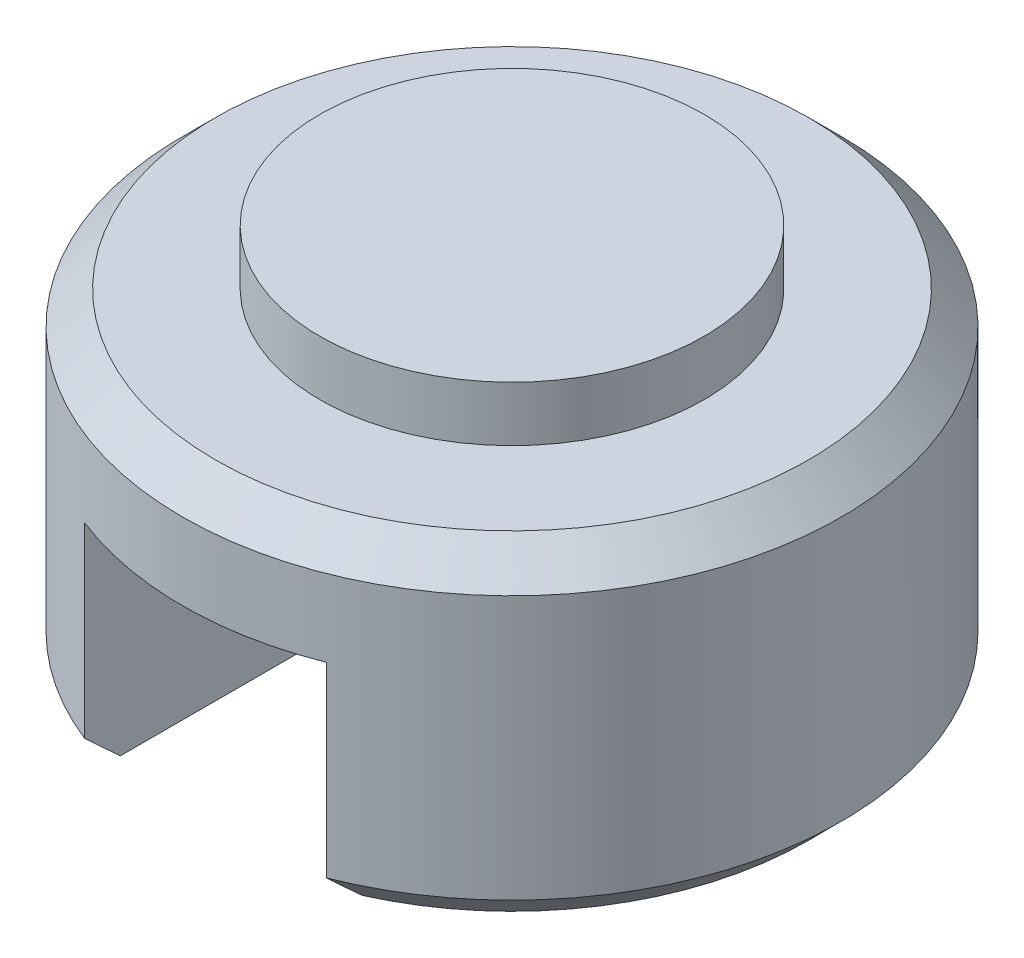
ISO-10303-21;
HEADER;
FILE_DESCRIPTION(('STEP AP214'),'2;1');
FILE_NAME('part.step','',(''),(''),'','','');
FILE_SCHEMA(('AUTOMOTIVE_DESIGN { 1 0 10303 214 1 1 1 1 }'));
ENDSEC;
DATA;
#1=APPLICATION_CONTEXT('core data for automotive mechanical design processes');
#2=APPLICATION_PROTOCOL_DEFINITION('international standard','automotive_design',2000,#1);
#3=PRODUCT_CONTEXT('',#1,'mechanical');
#4=PRODUCT('Part','Part','',(#3));
#5=PRODUCT_RELATED_PRODUCT_CATEGORY('part','',(#4));
#6=PRODUCT_DEFINITION_FORMATION('','',#4);
#7=PRODUCT_DEFINITION_CONTEXT('part definition',#1,'design');
#8=PRODUCT_DEFINITION('design','',#6,#7);
#9=PRODUCT_DEFINITION_SHAPE('','',#8);
#10=(LENGTH_UNIT() NAMED_UNIT(*) SI_UNIT(.MILLI.,.METRE.));
#11=(NAMED_UNIT(*) PLANE_ANGLE_UNIT() SI_UNIT($,.RADIAN.));
#12=(NAMED_UNIT(*) SI_UNIT($,.STERADIAN.) SOLID_ANGLE_UNIT());
#13=UNCERTAINTY_MEASURE_WITH_UNIT(LENGTH_MEASURE(1.E-05),#10,'distance_accuracy_value','');
#14=(GEOMETRIC_REPRESENTATION_CONTEXT(3) GLOBAL_UNCERTAINTY_ASSIGNED_CONTEXT((#13)) GLOBAL_UNIT_ASSIGNED_CONTEXT((#10,
#11,#12)) REPRESENTATION_CONTEXT('',''));
#15=CARTESIAN_POINT('',(0.,0.,0.));
#16=DIRECTION('',(0.,0.,1.));
#17=DIRECTION('',(1.,0.,0.));
#18=AXIS2_PLACEMENT_3D('',#15,#16,#17);
#19=CARTESIAN_POINT('',(-1.4986,-1.7272,-2.413));
#20=DIRECTION('',(0.,1.,0.));
#21=DIRECTION('',(0.,0.,1.));
#22=AXIS2_PLACEMENT_3D('',#19,#20,#21);
#23=PLANE('',#22);
#24=CARTESIAN_POINT('',(-1.4986,-1.7272,-2.413));
#25=DIRECTION('',(0.,-1.,0.));
#26=DIRECTION('',(0.,0.,-1.));
#27=AXIS2_PLACEMENT_3D('',#24,#25,#26);
#28=CIRCLE('',#27,0.762);
#29=CARTESIAN_POINT('',(-1.778,-1.7272,-1.70407148456274));
#30=VERTEX_POINT('',#29);
#31=CARTESIAN_POINT('',(-1.2192,-1.7272,-1.70407148456287));
#32=VERTEX_POINT('',#31);
#33=EDGE_CURVE('E19',#30,#32,#28,.F.);
#34=ORIENTED_EDGE('',*,*,#33,.F.);
#35=DIRECTION('',(0.,0.,-1.));
#36=VECTOR('',#35,1.);
#37=CARTESIAN_POINT('',(-1.778,-1.7272,-2.41299985997082));
#38=LINE('',#37,#36);
#39=CARTESIAN_POINT('',(-1.778,-1.7272,-3.12192851543713));
#40=VERTEX_POINT('',#39);
#41=EDGE_CURVE('E67',#40,#30,#38,.F.);
#42=ORIENTED_EDGE('',*,*,#41,.F.);
#43=CARTESIAN_POINT('',(-1.4986,-1.7272,-2.413));
#44=DIRECTION('',(0.,-1.,0.));
#45=DIRECTION('',(0.,0.,-1.));
#46=AXIS2_PLACEMENT_3D('',#43,#44,#45);
#47=CIRCLE('',#46,0.762);
#48=CARTESIAN_POINT('',(-1.2192,-1.7272,-3.12192851543713));
#49=VERTEX_POINT('',#48);
#50=EDGE_CURVE('E74',#49,#40,#47,.F.);
#51=ORIENTED_EDGE('',*,*,#50,.F.);
#52=DIRECTION('',(0.,0.,-1.));
#53=VECTOR('',#52,1.);
#54=CARTESIAN_POINT('',(-1.2192,-1.7272,-2.41300013996594));
#55=LINE('',#54,#53);
#56=EDGE_CURVE('E70',#49,#32,#55,.F.);
#57=ORIENTED_EDGE('',*,*,#56,.T.);
#58=EDGE_LOOP('',(#34,#42,#51,#57));
#59=FACE_BOUND('',#58,.T.);
#60=ADVANCED_FACE('F16',(#59),#23,.F.);
#61=CARTESIAN_POINT('',(-1.4986,-1.3462,-2.41299995087691));
#62=DIRECTION('',(0.,1.,0.));
#63=DIRECTION('',(0.,0.,1.));
#64=AXIS2_PLACEMENT_3D('',#61,#62,#63);
#65=PLANE('',#64);
#66=CARTESIAN_POINT('',(-1.4986,-1.3462,-2.413));
#67=DIRECTION('',(0.,-1.,0.));
#68=DIRECTION('',(0.,0.,-1.));
#69=AXIS2_PLACEMENT_3D('',#66,#67,#68);
#70=CIRCLE('',#69,0.4445);
#71=CARTESIAN_POINT('',(-1.4986,-1.3462,-2.8575));
#72=VERTEX_POINT('',#71);
#73=EDGE_CURVE('E104',#72,#72,#70,.T.);
#74=ORIENTED_EDGE('',*,*,#73,.F.);
#75=EDGE_LOOP('',(#74));
#76=FACE_BOUND('',#75,.T.);
#77=ADVANCED_FACE('F154',(#76),#65,.T.);
#78=CARTESIAN_POINT('',(-1.778,-1.98120064167842,-2.41299985997082));
#79=DIRECTION('',(1.,0.,0.));
#80=DIRECTION('',(0.,0.,-1.));
#81=AXIS2_PLACEMENT_3D('',#78,#79,#80);
#82=PLANE('',#81);
#83=CARTESIAN_POINT('',(-1.77799998033145,-2.23520005533869,-3.0393043804287));
#84=CARTESIAN_POINT('',(-1.77799999016572,-2.2225635165552,-3.05313361230183));
#85=CARTESIAN_POINT('',(-1.77799999672191,-2.20989524076586,-3.06693357474173));
#86=CARTESIAN_POINT('',(-1.77800000327809,-2.18449522228523,-3.09447495304592));
#87=CARTESIAN_POINT('',(-1.77800000327809,-2.17176347962948,-3.10821636894298));
#88=CARTESIAN_POINT('',(-1.778,-2.15900000000342,-3.12192851543958));
#89=B_SPLINE_CURVE_WITH_KNOTS('',3,(#83,#84,#85,#86,#87,#88),.UNSPECIFIED.,.F.,.F.,(4,2,4),(0.,
0.0561989107844174,0.112397790107552),.UNSPECIFIED.);
#90=CARTESIAN_POINT('',(-1.778,-2.2352000283648,-3.03930443164851));
#91=VERTEX_POINT('',#90);
#92=CARTESIAN_POINT('',(-1.778,-2.15900000000288,-3.12192851543713));
#93=VERTEX_POINT('',#92);
#94=EDGE_CURVE('E142',#91,#93,#89,.T.);
#95=ORIENTED_EDGE('',*,*,#94,.T.);
#96=DIRECTION('',(0.,1.,0.));
#97=VECTOR('',#96,1.);
#98=CARTESIAN_POINT('',(-1.778,-1.98120064167842,-3.12192851543706));
#99=LINE('',#98,#97);
#100=EDGE_CURVE('E88',#93,#40,#99,.T.);
#101=ORIENTED_EDGE('',*,*,#100,.T.);
#102=ORIENTED_EDGE('',*,*,#41,.T.);
#103=DIRECTION('',(0.,1.,0.));
#104=VECTOR('',#103,1.);
#105=CARTESIAN_POINT('',(-1.778,-1.98120064167842,-1.70407148456269));
#106=LINE('',#105,#104);
#107=CARTESIAN_POINT('',(-1.778,-2.1590000534657,-1.70407154202793));
#108=VERTEX_POINT('',#107);
#109=EDGE_CURVE('E77',#30,#108,#106,.F.);
#110=ORIENTED_EDGE('',*,*,#109,.T.);
#111=CARTESIAN_POINT('',(-1.77800003719789,-2.15900012781875,-1.70407158006058));
#112=CARTESIAN_POINT('',(-1.77800001859895,-2.17176356577931,-1.71778370663565));
#113=CARTESIAN_POINT('',(-1.77800000619965,-2.1844952721957,-1.73152509759957));
#114=CARTESIAN_POINT('',(-1.77799999380035,-2.2098952290555,-1.75906641602039));
#115=CARTESIAN_POINT('',(-1.77799999380035,-2.22256347946336,-1.77286634351006));
#116=CARTESIAN_POINT('',(-1.778,-2.2351999982915,-1.78669553542139));
#117=B_SPLINE_CURVE_WITH_KNOTS('',3,(#111,#112,#113,#114,#115,#116),.UNSPECIFIED.,.F.,.F.,(4,2,
4),(0.,0.0561987505650383,0.112397532616329),.UNSPECIFIED.);
#118=CARTESIAN_POINT('',(-1.778,-2.23519999444256,-1.78669553120682));
#119=VERTEX_POINT('',#118);
#120=EDGE_CURVE('E83',#108,#119,#117,.T.);
#121=ORIENTED_EDGE('',*,*,#120,.T.);
#122=DIRECTION('',(0.,0.,1.));
#123=VECTOR('',#122,1.);
#124=CARTESIAN_POINT('',(-1.778,-2.2352,-2.41300000000025));
#125=LINE('',#124,#123);
#126=EDGE_CURVE('E107',#119,#91,#125,.F.);
#127=ORIENTED_EDGE('',*,*,#126,.T.);
#128=EDGE_LOOP('',(#95,#101,#102,#110,#121,#127));
#129=FACE_BOUND('',#128,.T.);
#130=ADVANCED_FACE('F87',(#129),#82,.T.);
#131=CARTESIAN_POINT('',(-1.2192,-1.98120064175691,-2.41300013996594));
#132=DIRECTION('',(1.,0.,0.));
#133=DIRECTION('',(0.,0.,-1.));
#134=AXIS2_PLACEMENT_3D('',#131,#132,#133);
#135=PLANE('',#134);
#136=DIRECTION('',(0.,0.,1.));
#137=VECTOR('',#136,1.);
#138=CARTESIAN_POINT('',(-1.2192,-2.2352,-2.41300000000025));
#139=LINE('',#138,#137);
#140=CARTESIAN_POINT('',(-1.2192,-2.23519997174926,-3.03930449364222));
#141=VERTEX_POINT('',#140);
#142=CARTESIAN_POINT('',(-1.2192,-2.23520000568704,-1.78669554351947));
#143=VERTEX_POINT('',#142);
#144=EDGE_CURVE('E103',#141,#143,#139,.T.);
#145=ORIENTED_EDGE('',*,*,#144,.T.);
#146=CARTESIAN_POINT('',(-1.2192,-2.15900000003543,-1.70407148453373));
#147=CARTESIAN_POINT('',(-1.2192,-2.17176347021186,-1.71778362447395));
#148=CARTESIAN_POINT('',(-1.2192,-2.18449520525468,-1.73152503212855));
#149=CARTESIAN_POINT('',(-1.2192,-2.20989521217468,-1.75906639056673));
#150=CARTESIAN_POINT('',(-1.2192,-2.22256348401636,-1.77286634138306));
#151=CARTESIAN_POINT('',(-1.2192,-2.23520002068896,-1.78669555994649));
#152=B_SPLINE_CURVE_WITH_KNOTS('',3,(#146,#147,#148,#149,#150,#151),.UNSPECIFIED.,.F.,.F.,(4,2,
4),(0.,0.0561988456622739,0.112397722749735),.UNSPECIFIED.);
#153=CARTESIAN_POINT('',(-1.2192,-2.1590000000313,-1.70407148456287));
#154=VERTEX_POINT('',#153);
#155=EDGE_CURVE('E34',#154,#143,#152,.T.);
#156=ORIENTED_EDGE('',*,*,#155,.F.);
#157=DIRECTION('',(0.,1.,0.));
#158=VECTOR('',#157,1.);
#159=CARTESIAN_POINT('',(-1.2192,-1.98120064175691,-1.70407148456294));
#160=LINE('',#159,#158);
#161=EDGE_CURVE('E202',#32,#154,#160,.F.);
#162=ORIENTED_EDGE('',*,*,#161,.F.);
#163=ORIENTED_EDGE('',*,*,#56,.F.);
#164=DIRECTION('',(0.,1.,0.));
#165=VECTOR('',#164,1.);
#166=CARTESIAN_POINT('',(-1.2192,-1.98120064175691,-3.12192851543706));
#167=LINE('',#166,#165);
#168=CARTESIAN_POINT('',(-1.2192,-2.1590000000186,-3.12192851545072));
#169=VERTEX_POINT('',#168);
#170=EDGE_CURVE('E200',#169,#49,#167,.T.);
#171=ORIENTED_EDGE('',*,*,#170,.F.);
#172=CARTESIAN_POINT('',(-1.2191999996736,-2.23519995308407,-3.03930451444034));
#173=CARTESIAN_POINT('',(-1.2191999998368,-2.22256342749589,-3.05313372043715));
#174=CARTESIAN_POINT('',(-1.2191999999456,-2.20989516683034,-3.06693365877106));
#175=CARTESIAN_POINT('',(-1.2192000000544,-2.18449518244589,-3.09447499241301));
#176=CARTESIAN_POINT('',(-1.2192000000544,-2.17176345876248,-3.10821638775378));
#177=CARTESIAN_POINT('',(-1.2192,-2.15900000003719,-3.12192851546438));
#178=B_SPLINE_CURVE_WITH_KNOTS('',3,(#172,#173,#174,#175,#176,#177),.UNSPECIFIED.,.F.,.F.,(4,2,
4),(0.,0.0561988268275426,0.112397622230618),.UNSPECIFIED.);
#179=EDGE_CURVE('E108',#141,#169,#178,.T.);
#180=ORIENTED_EDGE('',*,*,#179,.F.);
#181=EDGE_LOOP('',(#145,#156,#162,#163,#171,#180));
#182=FACE_BOUND('',#181,.T.);
#183=ADVANCED_FACE('F122',(#182),#135,.F.);
#184=CARTESIAN_POINT('',(-1.4986,-1.47837343568562,-2.413));
#185=DIRECTION('',(0.,-1.,0.));
#186=DIRECTION('',(0.,0.,-1.));
#187=AXIS2_PLACEMENT_3D('',#184,#185,#186);
#188=CYLINDRICAL_SURFACE('',#187,0.4445);
#189=ORIENTED_EDGE('',*,*,#73,.T.);
#190=EDGE_LOOP('',(#189));
#191=FACE_BOUND('',#190,.T.);
#192=CARTESIAN_POINT('',(-1.4986,-1.4732,-2.413));
#193=DIRECTION('',(0.,-1.,0.));
#194=DIRECTION('',(0.,0.,-1.));
#195=AXIS2_PLACEMENT_3D('',#192,#193,#194);
#196=CIRCLE('',#195,0.4445);
#197=CARTESIAN_POINT('',(-1.4986,-1.4732,-2.8575));
#198=VERTEX_POINT('',#197);
#199=EDGE_CURVE('E100',#198,#198,#196,.T.);
#200=ORIENTED_EDGE('',*,*,#199,.F.);
#201=EDGE_LOOP('',(#200));
#202=FACE_BOUND('',#201,.T.);
#203=ADVANCED_FACE('F183',(#191,#202),#188,.T.);
#204=CARTESIAN_POINT('',(-1.9812,-2.2352,-2.41300000000025));
#205=DIRECTION('',(0.,1.,0.));
#206=DIRECTION('',(0.,0.,1.));
#207=AXIS2_PLACEMENT_3D('',#204,#205,#206);
#208=PLANE('',#207);
#209=ORIENTED_EDGE('',*,*,#126,.F.);
#210=CARTESIAN_POINT('',(-1.4986,-2.23519999059363,-2.413));
#211=DIRECTION('',(0.,1.,0.));
#212=DIRECTION('',(0.,0.,1.));
#213=AXIS2_PLACEMENT_3D('',#210,#211,#212);
#214=CIRCLE('',#213,0.685800009412002);
#215=EDGE_CURVE('E97',#91,#119,#214,.T.);
#216=ORIENTED_EDGE('',*,*,#215,.F.);
#217=EDGE_LOOP('',(#209,#216));
#218=FACE_BOUND('',#217,.T.);
#219=ADVANCED_FACE('F179',(#218),#208,.F.);
#220=CARTESIAN_POINT('',(-1.016,-2.2352,-2.41300000000025));
#221=DIRECTION('',(0.,1.,0.));
#222=DIRECTION('',(0.,0.,1.));
#223=AXIS2_PLACEMENT_3D('',#220,#221,#222);
#224=PLANE('',#223);
#225=ORIENTED_EDGE('',*,*,#144,.F.);
#226=CARTESIAN_POINT('',(-1.4986,-2.23519999059363,-2.413));
#227=DIRECTION('',(0.,1.,0.));
#228=DIRECTION('',(0.,0.,1.));
#229=AXIS2_PLACEMENT_3D('',#226,#227,#228);
#230=CIRCLE('',#229,0.685800009412002);
#231=EDGE_CURVE('E95',#143,#141,#230,.T.);
#232=ORIENTED_EDGE('',*,*,#231,.F.);
#233=EDGE_LOOP('',(#225,#232));
#234=FACE_BOUND('',#233,.T.);
#235=ADVANCED_FACE('F174',(#234),#224,.F.);
#236=CARTESIAN_POINT('',(-1.4986,-1.4732,-2.413));
#237=DIRECTION('',(0.,1.,0.));
#238=DIRECTION('',(0.,0.,1.));
#239=AXIS2_PLACEMENT_3D('',#236,#237,#238);
#240=PLANE('',#239);
#241=ORIENTED_EDGE('',*,*,#199,.T.);
#242=EDGE_LOOP('',(#241));
#243=FACE_BOUND('',#242,.T.);
#244=CARTESIAN_POINT('',(-1.4986,-1.47320000007767,-2.413));
#245=DIRECTION('',(0.,-1.,0.));
#246=DIRECTION('',(0.,0.,-1.));
#247=AXIS2_PLACEMENT_3D('',#244,#245,#246);
#248=CIRCLE('',#247,0.685799999937547);
#249=CARTESIAN_POINT('',(-1.4986,-1.47320000007767,-3.09879999993755));
#250=VERTEX_POINT('',#249);
#251=EDGE_CURVE('E92',#250,#250,#248,.T.);
#252=ORIENTED_EDGE('',*,*,#251,.F.);
#253=EDGE_LOOP('',(#252));
#254=FACE_BOUND('',#253,.T.);
#255=ADVANCED_FACE('F138',(#243,#254),#240,.T.);
#256=CARTESIAN_POINT('',(-1.4986,-2.15900000000602,-2.413));
#257=DIRECTION('',(0.,1.,0.));
#258=DIRECTION('',(0.,0.,1.));
#259=AXIS2_PLACEMENT_3D('',#256,#257,#258);
#260=CONICAL_SURFACE('',#259,0.761999999999613,0.785398163397448);
#261=CARTESIAN_POINT('',(-1.4986,-2.159,-2.413));
#262=DIRECTION('',(0.,-1.,0.));
#263=DIRECTION('',(0.,0.,-1.));
#264=AXIS2_PLACEMENT_3D('',#261,#262,#263);
#265=CIRCLE('',#264,0.762);
#266=EDGE_CURVE('E81',#93,#108,#265,.F.);
#267=ORIENTED_EDGE('',*,*,#266,.F.);
#268=ORIENTED_EDGE('',*,*,#94,.F.);
#269=ORIENTED_EDGE('',*,*,#215,.T.);
#270=ORIENTED_EDGE('',*,*,#120,.F.);
#271=EDGE_LOOP('',(#267,#268,#269,#270));
#272=FACE_BOUND('',#271,.T.);
#273=ADVANCED_FACE('F132',(#272),#260,.T.);
#274=CARTESIAN_POINT('',(-1.4986,-2.15900000023339,-2.413));
#275=DIRECTION('',(0.,1.,0.));
#276=DIRECTION('',(0.,0.,1.));
#277=AXIS2_PLACEMENT_3D('',#274,#275,#276);
#278=CONICAL_SURFACE('',#277,0.761999999829083,0.785398163770437);
#279=ORIENTED_EDGE('',*,*,#155,.T.);
#280=ORIENTED_EDGE('',*,*,#231,.T.);
#281=ORIENTED_EDGE('',*,*,#179,.T.);
#282=CARTESIAN_POINT('',(-1.4986,-2.159,-2.413));
#283=DIRECTION('',(0.,-1.,0.));
#284=DIRECTION('',(0.,0.,-1.));
#285=AXIS2_PLACEMENT_3D('',#282,#283,#284);
#286=CIRCLE('',#285,0.762);
#287=EDGE_CURVE('E25',#154,#169,#286,.F.);
#288=ORIENTED_EDGE('',*,*,#287,.F.);
#289=EDGE_LOOP('',(#279,#280,#281,#288));
#290=FACE_BOUND('',#289,.T.);
#291=ADVANCED_FACE('F126',(#290),#278,.T.);
#292=CARTESIAN_POINT('',(-1.4986,-1.5493999999876,-2.413));
#293=DIRECTION('',(0.,-1.,0.));
#294=DIRECTION('',(0.,0.,-1.));
#295=AXIS2_PLACEMENT_3D('',#292,#293,#294);
#296=CONICAL_SURFACE('',#295,0.761999999847479,0.785398163397448);
#297=CARTESIAN_POINT('',(-1.4986,-1.5494,-2.413));
#298=DIRECTION('',(0.,-1.,0.));
#299=DIRECTION('',(0.,0.,-1.));
#300=AXIS2_PLACEMENT_3D('',#297,#298,#299);
#301=CIRCLE('',#300,0.762);
#302=CARTESIAN_POINT('',(-1.4986,-1.5494,-3.175));
#303=VERTEX_POINT('',#302);
#304=EDGE_CURVE('E11',#303,#303,#301,.T.);
#305=ORIENTED_EDGE('',*,*,#304,.F.);
#306=EDGE_LOOP('',(#305));
#307=FACE_BOUND('',#306,.T.);
#308=ORIENTED_EDGE('',*,*,#251,.T.);
#309=EDGE_LOOP('',(#308));
#310=FACE_BOUND('',#309,.T.);
#311=ADVANCED_FACE('F131',(#307,#310),#296,.T.);
#312=CARTESIAN_POINT('',(-1.4986,-2.171192,-2.413));
#313=DIRECTION('',(0.,-1.,0.));
#314=DIRECTION('',(0.,0.,-1.));
#315=AXIS2_PLACEMENT_3D('',#312,#313,#314);
#316=CYLINDRICAL_SURFACE('',#315,0.762);
#317=ORIENTED_EDGE('',*,*,#304,.T.);
#318=EDGE_LOOP('',(#317));
#319=FACE_BOUND('',#318,.T.);
#320=ORIENTED_EDGE('',*,*,#287,.T.);
#321=ORIENTED_EDGE('',*,*,#170,.T.);
#322=ORIENTED_EDGE('',*,*,#50,.T.);
#323=ORIENTED_EDGE('',*,*,#100,.F.);
#324=ORIENTED_EDGE('',*,*,#266,.T.);
#325=ORIENTED_EDGE('',*,*,#109,.F.);
#326=ORIENTED_EDGE('',*,*,#33,.T.);
#327=ORIENTED_EDGE('',*,*,#161,.T.);
#328=EDGE_LOOP('',(#320,#321,#322,#323,#324,#325,#326,#327));
#329=FACE_BOUND('',#328,.T.);
#330=ADVANCED_FACE('F79',(#319,#329),#316,.T.);
#331=CLOSED_SHELL('',(#60,#77,#130,#183,#203,#219,#235,#255,#273,#291,#311,#330));
#332=MANIFOLD_SOLID_BREP('B1',#331);
#333=ADVANCED_BREP_SHAPE_REPRESENTATION('',(#18,#332),#14);
#334=SHAPE_DEFINITION_REPRESENTATION(#9,#333);
ENDSEC;
END-ISO-10303-21;
